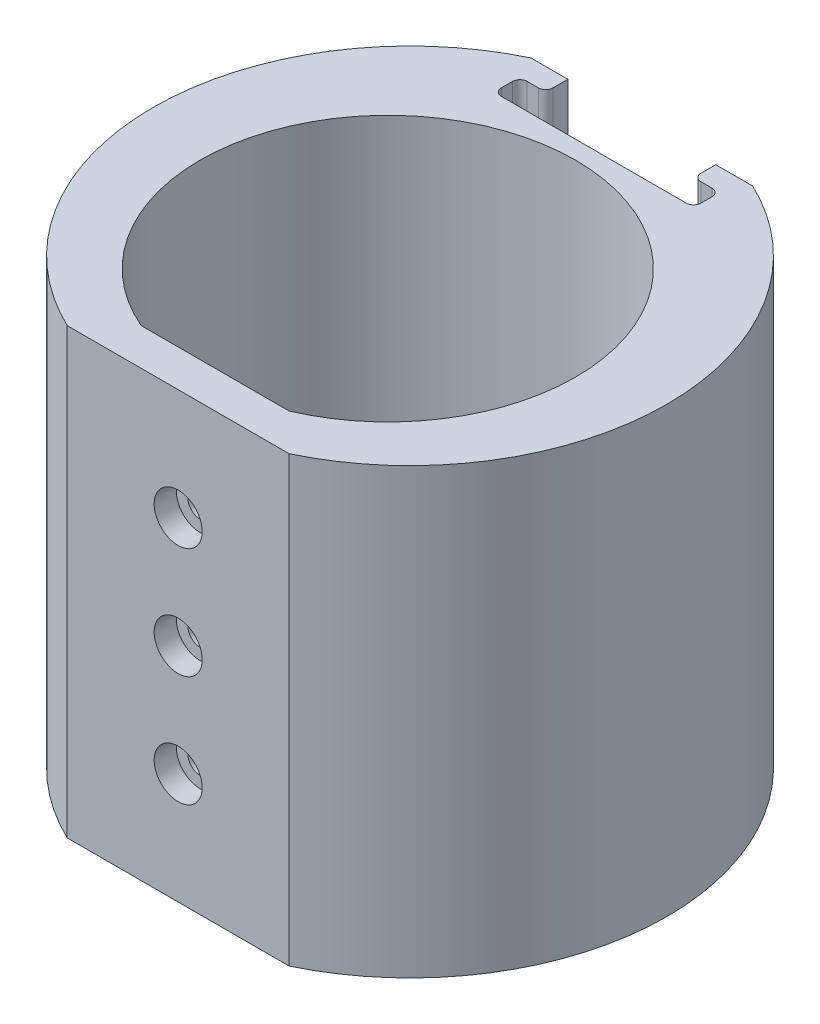
ISO-10303-21;
HEADER;
FILE_DESCRIPTION(('STEP AP214'),'2;1');
FILE_NAME('part.step','',(''),(''),'','','');
FILE_SCHEMA(('AUTOMOTIVE_DESIGN { 1 0 10303 214 1 1 1 1 }'));
ENDSEC;
DATA;
#1=APPLICATION_CONTEXT('core data for automotive mechanical design processes');
#2=APPLICATION_PROTOCOL_DEFINITION('international standard','automotive_design',2000,#1);
#3=PRODUCT_CONTEXT('',#1,'mechanical');
#4=PRODUCT('Part','Part','',(#3));
#5=PRODUCT_RELATED_PRODUCT_CATEGORY('part','',(#4));
#6=PRODUCT_DEFINITION_FORMATION('','',#4);
#7=PRODUCT_DEFINITION_CONTEXT('part definition',#1,'design');
#8=PRODUCT_DEFINITION('design','',#6,#7);
#9=PRODUCT_DEFINITION_SHAPE('','',#8);
#10=(LENGTH_UNIT() NAMED_UNIT(*) SI_UNIT(.MILLI.,.METRE.));
#11=(NAMED_UNIT(*) PLANE_ANGLE_UNIT() SI_UNIT($,.RADIAN.));
#12=(NAMED_UNIT(*) SI_UNIT($,.STERADIAN.) SOLID_ANGLE_UNIT());
#13=UNCERTAINTY_MEASURE_WITH_UNIT(LENGTH_MEASURE(1.E-05),#10,'distance_accuracy_value','');
#14=(GEOMETRIC_REPRESENTATION_CONTEXT(3) GLOBAL_UNCERTAINTY_ASSIGNED_CONTEXT((#13)) GLOBAL_UNIT_ASSIGNED_CONTEXT((#10,
#11,#12)) REPRESENTATION_CONTEXT('',''));
#15=CARTESIAN_POINT('',(0.,0.,0.));
#16=DIRECTION('',(0.,0.,1.));
#17=DIRECTION('',(1.,0.,0.));
#18=AXIS2_PLACEMENT_3D('',#15,#16,#17);
#19=CARTESIAN_POINT('',(-10.,30.,23.3486616318795));
#20=DIRECTION('',(0.,0.,-1.));
#21=DIRECTION('',(-1.,0.,0.));
#22=AXIS2_PLACEMENT_3D('',#19,#20,#21);
#23=PLANE('',#22);
#24=CARTESIAN_POINT('',(0.,0.,23.3486616318795));
#25=DIRECTION('',(0.,0.,-1.));
#26=DIRECTION('',(-1.,0.,0.));
#27=AXIS2_PLACEMENT_3D('',#24,#25,#26);
#28=CIRCLE('',#27,1.7);
#29=CARTESIAN_POINT('',(-1.7,0.,23.3486616318795));
#30=VERTEX_POINT('',#29);
#31=EDGE_CURVE('E747',#30,#30,#28,.F.);
#32=ORIENTED_EDGE('',*,*,#31,.T.);
#33=EDGE_LOOP('',(#32));
#34=FACE_BOUND('',#33,.T.);
#35=DIRECTION('',(1.,0.,0.));
#36=VECTOR('',#35,1.);
#37=CARTESIAN_POINT('',(-10.,-30.,23.3486616318795));
#38=LINE('',#37,#36);
#39=CARTESIAN_POINT('',(-10.,-30.,23.3486616318795));
#40=VERTEX_POINT('',#39);
#41=CARTESIAN_POINT('',(10.,-30.,23.3486616318795));
#42=VERTEX_POINT('',#41);
#43=EDGE_CURVE('E337',#40,#42,#38,.T.);
#44=ORIENTED_EDGE('',*,*,#43,.F.);
#45=DIRECTION('',(0.,-1.,0.));
#46=VECTOR('',#45,1.);
#47=CARTESIAN_POINT('',(-10.,30.,23.3486616318795));
#48=LINE('',#47,#46);
#49=CARTESIAN_POINT('',(-10.,30.,23.3486616318795));
#50=VERTEX_POINT('',#49);
#51=EDGE_CURVE('E221',#50,#40,#48,.T.);
#52=ORIENTED_EDGE('',*,*,#51,.F.);
#53=DIRECTION('',(1.,0.,0.));
#54=VECTOR('',#53,1.);
#55=CARTESIAN_POINT('',(-10.,30.,23.3486616318795));
#56=LINE('',#55,#54);
#57=CARTESIAN_POINT('',(10.,30.,23.3486616318795));
#58=VERTEX_POINT('',#57);
#59=EDGE_CURVE('E336',#50,#58,#56,.T.);
#60=ORIENTED_EDGE('',*,*,#59,.T.);
#61=DIRECTION('',(0.,-1.,0.));
#62=VECTOR('',#61,1.);
#63=CARTESIAN_POINT('',(10.,30.,23.3486616318795));
#64=LINE('',#63,#62);
#65=EDGE_CURVE('E339',#58,#42,#64,.T.);
#66=ORIENTED_EDGE('',*,*,#65,.T.);
#67=EDGE_LOOP('',(#44,#52,#60,#66));
#68=FACE_BOUND('',#67,.T.);
#69=CARTESIAN_POINT('',(1.56198175148581E-13,-15.,23.3486616318795));
#70=DIRECTION('',(0.,0.,-1.));
#71=DIRECTION('',(-1.,0.,0.));
#72=AXIS2_PLACEMENT_3D('',#69,#70,#71);
#73=CIRCLE('',#72,1.7);
#74=CARTESIAN_POINT('',(-1.69999999999984,-15.,23.3486616318795));
#75=VERTEX_POINT('',#74);
#76=EDGE_CURVE('E758',#75,#75,#73,.F.);
#77=ORIENTED_EDGE('',*,*,#76,.T.);
#78=EDGE_LOOP('',(#77));
#79=FACE_BOUND('',#78,.T.);
#80=CARTESIAN_POINT('',(0.,15.,23.3486616318795));
#81=DIRECTION('',(0.,0.,-1.));
#82=DIRECTION('',(-1.,0.,0.));
#83=AXIS2_PLACEMENT_3D('',#80,#81,#82);
#84=CIRCLE('',#83,1.7);
#85=CARTESIAN_POINT('',(-1.7,15.,23.3486616318795));
#86=VERTEX_POINT('',#85);
#87=EDGE_CURVE('E735',#86,#86,#84,.F.);
#88=ORIENTED_EDGE('',*,*,#87,.T.);
#89=EDGE_LOOP('',(#88));
#90=FACE_BOUND('',#89,.T.);
#91=ADVANCED_FACE('F41',(#34,#68,#79,#90),#23,.T.);
#92=CARTESIAN_POINT('',(0.,30.,-3.));
#93=DIRECTION('',(0.,1.,0.));
#94=DIRECTION('',(0.,0.,1.));
#95=AXIS2_PLACEMENT_3D('',#92,#93,#94);
#96=PLANE('',#95);
#97=DIRECTION('',(0.,0.,-1.));
#98=VECTOR('',#97,1.);
#99=CARTESIAN_POINT('',(10.,30.,-31.3486616318795));
#100=LINE('',#99,#98);
#101=CARTESIAN_POINT('',(10.,30.,-32.3486616318795));
#102=VERTEX_POINT('',#101);
#103=CARTESIAN_POINT('',(10.,30.,-34.3486616318795));
#104=VERTEX_POINT('',#103);
#105=EDGE_CURVE('E191',#102,#104,#100,.T.);
#106=ORIENTED_EDGE('',*,*,#105,.F.);
#107=CARTESIAN_POINT('',(11.,30.,-32.3486616318795));
#108=DIRECTION('',(0.,1.,0.));
#109=DIRECTION('',(0.,0.,1.));
#110=AXIS2_PLACEMENT_3D('',#107,#108,#109);
#111=CIRCLE('',#110,1.);
#112=CARTESIAN_POINT('',(11.,30.,-31.3486616318795));
#113=VERTEX_POINT('',#112);
#114=EDGE_CURVE('E242',#102,#113,#111,.T.);
#115=ORIENTED_EDGE('',*,*,#114,.T.);
#116=DIRECTION('',(-1.,0.,0.));
#117=VECTOR('',#116,1.);
#118=CARTESIAN_POINT('',(13.5,30.,-31.3486616318795));
#119=LINE('',#118,#117);
#120=CARTESIAN_POINT('',(12.5,30.,-31.3486616318795));
#121=VERTEX_POINT('',#120);
#122=EDGE_CURVE('E325',#121,#113,#119,.T.);
#123=ORIENTED_EDGE('',*,*,#122,.F.);
#124=CARTESIAN_POINT('',(12.5,30.,-30.3486616318795));
#125=DIRECTION('',(0.,1.,0.));
#126=DIRECTION('',(0.,0.,1.));
#127=AXIS2_PLACEMENT_3D('',#124,#125,#126);
#128=CIRCLE('',#127,1.);
#129=CARTESIAN_POINT('',(13.5,30.,-30.3486616318795));
#130=VERTEX_POINT('',#129);
#131=EDGE_CURVE('E281',#121,#130,#128,.F.);
#132=ORIENTED_EDGE('',*,*,#131,.T.);
#133=DIRECTION('',(0.,0.,-1.));
#134=VECTOR('',#133,1.);
#135=CARTESIAN_POINT('',(13.5,30.,-27.8486616318795));
#136=LINE('',#135,#134);
#137=CARTESIAN_POINT('',(13.5,30.,-28.8486616318795));
#138=VERTEX_POINT('',#137);
#139=EDGE_CURVE('E322',#138,#130,#136,.T.);
#140=ORIENTED_EDGE('',*,*,#139,.F.);
#141=CARTESIAN_POINT('',(12.5,30.,-28.8486616318795));
#142=DIRECTION('',(0.,1.,0.));
#143=DIRECTION('',(0.,0.,1.));
#144=AXIS2_PLACEMENT_3D('',#141,#142,#143);
#145=CIRCLE('',#144,1.);
#146=CARTESIAN_POINT('',(12.5,30.,-27.8486616318795));
#147=VERTEX_POINT('',#146);
#148=EDGE_CURVE('E279',#138,#147,#145,.F.);
#149=ORIENTED_EDGE('',*,*,#148,.T.);
#150=DIRECTION('',(1.,0.,0.));
#151=VECTOR('',#150,1.);
#152=CARTESIAN_POINT('',(-13.5,30.,-27.8486616318795));
#153=LINE('',#152,#151);
#154=CARTESIAN_POINT('',(-12.5,30.,-27.8486616318795));
#155=VERTEX_POINT('',#154);
#156=EDGE_CURVE('E319',#155,#147,#153,.T.);
#157=ORIENTED_EDGE('',*,*,#156,.F.);
#158=CARTESIAN_POINT('',(-12.5,30.,-28.8486616318795));
#159=DIRECTION('',(0.,1.,0.));
#160=DIRECTION('',(0.,0.,1.));
#161=AXIS2_PLACEMENT_3D('',#158,#159,#160);
#162=CIRCLE('',#161,1.);
#163=CARTESIAN_POINT('',(-13.5,30.,-28.8486616318795));
#164=VERTEX_POINT('',#163);
#165=EDGE_CURVE('E283',#155,#164,#162,.F.);
#166=ORIENTED_EDGE('',*,*,#165,.T.);
#167=DIRECTION('',(0.,0.,1.));
#168=VECTOR('',#167,1.);
#169=CARTESIAN_POINT('',(-13.5,30.,-31.3486616318795));
#170=LINE('',#169,#168);
#171=CARTESIAN_POINT('',(-13.5,30.,-30.3486616318795));
#172=VERTEX_POINT('',#171);
#173=EDGE_CURVE('E286',#172,#164,#170,.T.);
#174=ORIENTED_EDGE('',*,*,#173,.F.);
#175=CARTESIAN_POINT('',(-12.5,30.,-30.3486616318795));
#176=DIRECTION('',(0.,1.,0.));
#177=DIRECTION('',(0.,0.,1.));
#178=AXIS2_PLACEMENT_3D('',#175,#176,#177);
#179=CIRCLE('',#178,1.);
#180=CARTESIAN_POINT('',(-12.5,30.,-31.3486616318795));
#181=VERTEX_POINT('',#180);
#182=EDGE_CURVE('E49',#172,#181,#179,.F.);
#183=ORIENTED_EDGE('',*,*,#182,.T.);
#184=DIRECTION('',(-1.,0.,0.));
#185=VECTOR('',#184,1.);
#186=CARTESIAN_POINT('',(-10.,30.,-31.3486616318795));
#187=LINE('',#186,#185);
#188=CARTESIAN_POINT('',(-11.,30.,-31.3486616318795));
#189=VERTEX_POINT('',#188);
#190=EDGE_CURVE('E202',#189,#181,#187,.T.);
#191=ORIENTED_EDGE('',*,*,#190,.F.);
#192=CARTESIAN_POINT('',(-11.,30.,-32.3486616318795));
#193=DIRECTION('',(0.,1.,0.));
#194=DIRECTION('',(0.,0.,1.));
#195=AXIS2_PLACEMENT_3D('',#192,#193,#194);
#196=CIRCLE('',#195,1.);
#197=CARTESIAN_POINT('',(-10.,30.,-32.3486616318795));
#198=VERTEX_POINT('',#197);
#199=EDGE_CURVE('E201',#189,#198,#196,.T.);
#200=ORIENTED_EDGE('',*,*,#199,.T.);
#201=DIRECTION('',(0.,0.,1.));
#202=VECTOR('',#201,1.);
#203=CARTESIAN_POINT('',(-10.,30.,-34.3486616318795));
#204=LINE('',#203,#202);
#205=CARTESIAN_POINT('',(-10.,30.,-34.3486616318795));
#206=VERTEX_POINT('',#205);
#207=EDGE_CURVE('E182',#206,#198,#204,.T.);
#208=ORIENTED_EDGE('',*,*,#207,.F.);
#209=DIRECTION('',(-1.,0.,0.));
#210=VECTOR('',#209,1.);
#211=CARTESIAN_POINT('',(-15.,30.,-34.3486616318795));
#212=LINE('',#211,#210);
#213=CARTESIAN_POINT('',(-15.,30.,-34.3486616318795));
#214=VERTEX_POINT('',#213);
#215=EDGE_CURVE('E198',#206,#214,#212,.T.);
#216=ORIENTED_EDGE('',*,*,#215,.T.);
#217=CARTESIAN_POINT('',(0.,30.,-3.));
#218=DIRECTION('',(0.,1.,0.));
#219=DIRECTION('',(0.,0.,1.));
#220=AXIS2_PLACEMENT_3D('',#217,#218,#219);
#221=CIRCLE('',#220,34.7525335207388);
#222=CARTESIAN_POINT('',(-15.,30.,28.3486616318795));
#223=VERTEX_POINT('',#222);
#224=EDGE_CURVE('E227',#214,#223,#221,.T.);
#225=ORIENTED_EDGE('',*,*,#224,.T.);
#226=DIRECTION('',(1.,0.,0.));
#227=VECTOR('',#226,1.);
#228=CARTESIAN_POINT('',(-15.,30.,28.3486616318795));
#229=LINE('',#228,#227);
#230=CARTESIAN_POINT('',(15.,30.,28.3486616318795));
#231=VERTEX_POINT('',#230);
#232=EDGE_CURVE('E213',#223,#231,#229,.T.);
#233=ORIENTED_EDGE('',*,*,#232,.T.);
#234=CARTESIAN_POINT('',(0.,30.,-3.));
#235=DIRECTION('',(0.,1.,0.));
#236=DIRECTION('',(0.,0.,1.));
#237=AXIS2_PLACEMENT_3D('',#234,#235,#236);
#238=CIRCLE('',#237,34.7525335207388);
#239=CARTESIAN_POINT('',(15.,30.,-34.3486616318795));
#240=VERTEX_POINT('',#239);
#241=EDGE_CURVE('E210',#231,#240,#238,.T.);
#242=ORIENTED_EDGE('',*,*,#241,.T.);
#243=EDGE_CURVE('E209',#240,#104,#212,.T.);
#244=ORIENTED_EDGE('',*,*,#243,.T.);
#245=EDGE_LOOP('',(#106,#115,#123,#132,#140,#149,#157,#166,#174,#183,#191,#200,#208,#216,#225,
#233,#242,#244));
#246=FACE_BOUND('',#245,.T.);
#247=ORIENTED_EDGE('',*,*,#59,.F.);
#248=CARTESIAN_POINT('',(0.,30.,0.));
#249=DIRECTION('',(0.,1.,0.));
#250=DIRECTION('',(0.,0.,1.));
#251=AXIS2_PLACEMENT_3D('',#248,#249,#250);
#252=CIRCLE('',#251,25.4);
#253=EDGE_CURVE('E333',#58,#50,#252,.T.);
#254=ORIENTED_EDGE('',*,*,#253,.F.);
#255=EDGE_LOOP('',(#247,#254));
#256=FACE_BOUND('',#255,.T.);
#257=ADVANCED_FACE('F195',(#246,#256),#96,.T.);
#258=CARTESIAN_POINT('',(0.,-30.,-3.));
#259=DIRECTION('',(0.,1.,0.));
#260=DIRECTION('',(0.,0.,1.));
#261=AXIS2_PLACEMENT_3D('',#258,#259,#260);
#262=PLANE('',#261);
#263=CARTESIAN_POINT('',(0.,-30.,-3.));
#264=DIRECTION('',(0.,1.,0.));
#265=DIRECTION('',(0.,0.,1.));
#266=AXIS2_PLACEMENT_3D('',#263,#264,#265);
#267=CIRCLE('',#266,34.7525335207388);
#268=CARTESIAN_POINT('',(-15.,-30.,-34.3486616318795));
#269=VERTEX_POINT('',#268);
#270=CARTESIAN_POINT('',(-15.,-30.,28.3486616318795));
#271=VERTEX_POINT('',#270);
#272=EDGE_CURVE('E217',#269,#271,#267,.T.);
#273=ORIENTED_EDGE('',*,*,#272,.F.);
#274=DIRECTION('',(-1.,0.,0.));
#275=VECTOR('',#274,1.);
#276=CARTESIAN_POINT('',(-15.,-30.,-34.3486616318795));
#277=LINE('',#276,#275);
#278=CARTESIAN_POINT('',(15.,-30.,-34.3486616318795));
#279=VERTEX_POINT('',#278);
#280=EDGE_CURVE('E225',#279,#269,#277,.T.);
#281=ORIENTED_EDGE('',*,*,#280,.F.);
#282=CARTESIAN_POINT('',(0.,-30.,-3.));
#283=DIRECTION('',(0.,1.,0.));
#284=DIRECTION('',(0.,0.,1.));
#285=AXIS2_PLACEMENT_3D('',#282,#283,#284);
#286=CIRCLE('',#285,34.7525335207388);
#287=CARTESIAN_POINT('',(15.,-30.,28.3486616318795));
#288=VERTEX_POINT('',#287);
#289=EDGE_CURVE('E223',#288,#279,#286,.T.);
#290=ORIENTED_EDGE('',*,*,#289,.F.);
#291=DIRECTION('',(1.,0.,0.));
#292=VECTOR('',#291,1.);
#293=CARTESIAN_POINT('',(-15.,-30.,28.3486616318795));
#294=LINE('',#293,#292);
#295=EDGE_CURVE('E220',#271,#288,#294,.T.);
#296=ORIENTED_EDGE('',*,*,#295,.F.);
#297=EDGE_LOOP('',(#273,#281,#290,#296));
#298=FACE_BOUND('',#297,.T.);
#299=CARTESIAN_POINT('',(0.,-30.,0.));
#300=DIRECTION('',(0.,1.,0.));
#301=DIRECTION('',(0.,0.,1.));
#302=AXIS2_PLACEMENT_3D('',#299,#300,#301);
#303=CIRCLE('',#302,25.4);
#304=EDGE_CURVE('E332',#42,#40,#303,.T.);
#305=ORIENTED_EDGE('',*,*,#304,.T.);
#306=ORIENTED_EDGE('',*,*,#43,.T.);
#307=EDGE_LOOP('',(#305,#306));
#308=FACE_BOUND('',#307,.T.);
#309=ADVANCED_FACE('F406',(#298,#308),#262,.F.);
#310=CARTESIAN_POINT('',(0.,30.,-3.));
#311=DIRECTION('',(0.,-1.,0.));
#312=DIRECTION('',(0.,0.,-1.));
#313=AXIS2_PLACEMENT_3D('',#310,#311,#312);
#314=CYLINDRICAL_SURFACE('',#313,34.7525335207388);
#315=ORIENTED_EDGE('',*,*,#272,.T.);
#316=DIRECTION('',(0.,-1.,0.));
#317=VECTOR('',#316,1.);
#318=CARTESIAN_POINT('',(-15.,30.,28.3486616318795));
#319=LINE('',#318,#317);
#320=EDGE_CURVE('E235',#223,#271,#319,.T.);
#321=ORIENTED_EDGE('',*,*,#320,.F.);
#322=ORIENTED_EDGE('',*,*,#224,.F.);
#323=DIRECTION('',(0.,-1.,0.));
#324=VECTOR('',#323,1.);
#325=CARTESIAN_POINT('',(-15.,30.,-34.3486616318795));
#326=LINE('',#325,#324);
#327=EDGE_CURVE('E207',#214,#269,#326,.T.);
#328=ORIENTED_EDGE('',*,*,#327,.T.);
#329=EDGE_LOOP('',(#315,#321,#322,#328));
#330=FACE_BOUND('',#329,.T.);
#331=ADVANCED_FACE('F419',(#330),#314,.T.);
#332=CARTESIAN_POINT('',(-15.,30.,28.3486616318795));
#333=DIRECTION('',(0.,0.,-1.));
#334=DIRECTION('',(-1.,0.,0.));
#335=AXIS2_PLACEMENT_3D('',#332,#333,#334);
#336=PLANE('',#335);
#337=CARTESIAN_POINT('',(0.,15.,28.3486616318795));
#338=DIRECTION('',(0.,0.,1.));
#339=DIRECTION('',(1.,0.,0.));
#340=AXIS2_PLACEMENT_3D('',#337,#338,#339);
#341=CIRCLE('',#340,3.25);
#342=CARTESIAN_POINT('',(3.25,15.,28.3486616318795));
#343=VERTEX_POINT('',#342);
#344=EDGE_CURVE('E734',#343,#343,#341,.T.);
#345=ORIENTED_EDGE('',*,*,#344,.F.);
#346=EDGE_LOOP('',(#345));
#347=FACE_BOUND('',#346,.T.);
#348=CARTESIAN_POINT('',(0.,0.,28.3486616318795));
#349=DIRECTION('',(0.,0.,1.));
#350=DIRECTION('',(1.,0.,0.));
#351=AXIS2_PLACEMENT_3D('',#348,#349,#350);
#352=CIRCLE('',#351,3.25);
#353=CARTESIAN_POINT('',(3.25,0.,28.3486616318795));
#354=VERTEX_POINT('',#353);
#355=EDGE_CURVE('E751',#354,#354,#352,.T.);
#356=ORIENTED_EDGE('',*,*,#355,.F.);
#357=EDGE_LOOP('',(#356));
#358=FACE_BOUND('',#357,.T.);
#359=CARTESIAN_POINT('',(1.56198175148581E-13,-15.,28.3486616318795));
#360=DIRECTION('',(0.,0.,1.));
#361=DIRECTION('',(1.,0.,0.));
#362=AXIS2_PLACEMENT_3D('',#359,#360,#361);
#363=CIRCLE('',#362,3.25);
#364=CARTESIAN_POINT('',(3.25000000000015,-15.,28.3486616318795));
#365=VERTEX_POINT('',#364);
#366=EDGE_CURVE('E750',#365,#365,#363,.T.);
#367=ORIENTED_EDGE('',*,*,#366,.F.);
#368=EDGE_LOOP('',(#367));
#369=FACE_BOUND('',#368,.T.);
#370=ORIENTED_EDGE('',*,*,#295,.T.);
#371=DIRECTION('',(0.,-1.,0.));
#372=VECTOR('',#371,1.);
#373=CARTESIAN_POINT('',(15.,30.,28.3486616318795));
#374=LINE('',#373,#372);
#375=EDGE_CURVE('E232',#231,#288,#374,.T.);
#376=ORIENTED_EDGE('',*,*,#375,.F.);
#377=ORIENTED_EDGE('',*,*,#232,.F.);
#378=ORIENTED_EDGE('',*,*,#320,.T.);
#379=EDGE_LOOP('',(#370,#376,#377,#378));
#380=FACE_BOUND('',#379,.T.);
#381=ADVANCED_FACE('F353',(#347,#358,#369,#380),#336,.F.);
#382=CARTESIAN_POINT('',(0.,30.,-3.));
#383=DIRECTION('',(0.,-1.,0.));
#384=DIRECTION('',(0.,0.,-1.));
#385=AXIS2_PLACEMENT_3D('',#382,#383,#384);
#386=CYLINDRICAL_SURFACE('',#385,34.7525335207388);
#387=ORIENTED_EDGE('',*,*,#289,.T.);
#388=DIRECTION('',(0.,-1.,0.));
#389=VECTOR('',#388,1.);
#390=CARTESIAN_POINT('',(15.,30.,-34.3486616318795));
#391=LINE('',#390,#389);
#392=EDGE_CURVE('E229',#240,#279,#391,.T.);
#393=ORIENTED_EDGE('',*,*,#392,.F.);
#394=ORIENTED_EDGE('',*,*,#241,.F.);
#395=ORIENTED_EDGE('',*,*,#375,.T.);
#396=EDGE_LOOP('',(#387,#393,#394,#395));
#397=FACE_BOUND('',#396,.T.);
#398=ADVANCED_FACE('F356',(#397),#386,.T.);
#399=CARTESIAN_POINT('',(-15.,30.,-34.3486616318795));
#400=DIRECTION('',(0.,0.,1.));
#401=DIRECTION('',(1.,0.,0.));
#402=AXIS2_PLACEMENT_3D('',#399,#400,#401);
#403=PLANE('',#402);
#404=DIRECTION('',(1.,0.,0.));
#405=VECTOR('',#404,1.);
#406=CARTESIAN_POINT('',(10.,-20.,-34.3486616318795));
#407=LINE('',#406,#405);
#408=CARTESIAN_POINT('',(-10.,-20.,-34.3486616318795));
#409=VERTEX_POINT('',#408);
#410=CARTESIAN_POINT('',(10.,-20.,-34.3486616318795));
#411=VERTEX_POINT('',#410);
#412=EDGE_CURVE('E316',#409,#411,#407,.T.);
#413=ORIENTED_EDGE('',*,*,#412,.T.);
#414=DIRECTION('',(0.,1.,0.));
#415=VECTOR('',#414,1.);
#416=CARTESIAN_POINT('',(10.,-57.7713881539976,-34.3486616318795));
#417=LINE('',#416,#415);
#418=EDGE_CURVE('E190',#411,#104,#417,.T.);
#419=ORIENTED_EDGE('',*,*,#418,.T.);
#420=ORIENTED_EDGE('',*,*,#243,.F.);
#421=ORIENTED_EDGE('',*,*,#392,.T.);
#422=ORIENTED_EDGE('',*,*,#280,.T.);
#423=ORIENTED_EDGE('',*,*,#327,.F.);
#424=ORIENTED_EDGE('',*,*,#215,.F.);
#425=DIRECTION('',(0.,1.,0.));
#426=VECTOR('',#425,1.);
#427=CARTESIAN_POINT('',(-10.,-57.7713881539976,-34.3486616318795));
#428=LINE('',#427,#426);
#429=EDGE_CURVE('E179',#409,#206,#428,.T.);
#430=ORIENTED_EDGE('',*,*,#429,.F.);
#431=EDGE_LOOP('',(#413,#419,#420,#421,#422,#423,#424,#430));
#432=FACE_BOUND('',#431,.T.);
#433=ADVANCED_FACE('F205',(#432),#403,.F.);
#434=CARTESIAN_POINT('',(0.,30.,0.));
#435=DIRECTION('',(0.,-1.,0.));
#436=DIRECTION('',(0.,0.,-1.));
#437=AXIS2_PLACEMENT_3D('',#434,#435,#436);
#438=CYLINDRICAL_SURFACE('',#437,25.4);
#439=ORIENTED_EDGE('',*,*,#304,.F.);
#440=ORIENTED_EDGE('',*,*,#65,.F.);
#441=ORIENTED_EDGE('',*,*,#253,.T.);
#442=ORIENTED_EDGE('',*,*,#51,.T.);
#443=EDGE_LOOP('',(#439,#440,#441,#442));
#444=FACE_BOUND('',#443,.T.);
#445=ADVANCED_FACE('F413',(#444),#438,.F.);
#446=CARTESIAN_POINT('',(10.,-57.7713881539976,-31.3486616318795));
#447=DIRECTION('',(1.,0.,0.));
#448=DIRECTION('',(0.,0.,-1.));
#449=AXIS2_PLACEMENT_3D('',#446,#447,#448);
#450=PLANE('',#449);
#451=DIRECTION('',(0.,0.,1.));
#452=VECTOR('',#451,1.);
#453=CARTESIAN_POINT('',(10.,-20.,-31.3486616318795));
#454=LINE('',#453,#452);
#455=CARTESIAN_POINT('',(10.,-20.,-32.3486616318795));
#456=VERTEX_POINT('',#455);
#457=EDGE_CURVE('E313',#411,#456,#454,.T.);
#458=ORIENTED_EDGE('',*,*,#457,.T.);
#459=DIRECTION('',(0.,1.,0.));
#460=VECTOR('',#459,1.);
#461=CARTESIAN_POINT('',(10.,-57.7713881539976,-32.3486616318795));
#462=LINE('',#461,#460);
#463=EDGE_CURVE('E238',#456,#102,#462,.T.);
#464=ORIENTED_EDGE('',*,*,#463,.T.);
#465=ORIENTED_EDGE('',*,*,#105,.T.);
#466=ORIENTED_EDGE('',*,*,#418,.F.);
#467=EDGE_LOOP('',(#458,#464,#465,#466));
#468=FACE_BOUND('',#467,.T.);
#469=ADVANCED_FACE('F361',(#468),#450,.F.);
#470=CARTESIAN_POINT('',(13.5,-57.7713881539976,-31.3486616318795));
#471=DIRECTION('',(0.,0.,-1.));
#472=DIRECTION('',(-1.,0.,0.));
#473=AXIS2_PLACEMENT_3D('',#470,#471,#472);
#474=PLANE('',#473);
#475=ORIENTED_EDGE('',*,*,#122,.T.);
#476=DIRECTION('',(0.,1.,0.));
#477=VECTOR('',#476,1.);
#478=CARTESIAN_POINT('',(11.,-57.7713881539976,-31.3486616318795));
#479=LINE('',#478,#477);
#480=CARTESIAN_POINT('',(11.,-20.,-31.3486616318795));
#481=VERTEX_POINT('',#480);
#482=EDGE_CURVE('E247',#113,#481,#479,.F.);
#483=ORIENTED_EDGE('',*,*,#482,.T.);
#484=DIRECTION('',(1.,0.,0.));
#485=VECTOR('',#484,1.);
#486=CARTESIAN_POINT('',(13.5,-20.,-31.3486616318795));
#487=LINE('',#486,#485);
#488=CARTESIAN_POINT('',(12.5,-20.,-31.3486616318795));
#489=VERTEX_POINT('',#488);
#490=EDGE_CURVE('E310',#481,#489,#487,.T.);
#491=ORIENTED_EDGE('',*,*,#490,.T.);
#492=DIRECTION('',(0.,1.,0.));
#493=VECTOR('',#492,1.);
#494=CARTESIAN_POINT('',(12.5,30.,-31.3486616318795));
#495=LINE('',#494,#493);
#496=EDGE_CURVE('E244',#489,#121,#495,.T.);
#497=ORIENTED_EDGE('',*,*,#496,.T.);
#498=EDGE_LOOP('',(#475,#483,#491,#497));
#499=FACE_BOUND('',#498,.T.);
#500=ADVANCED_FACE('F370',(#499),#474,.F.);
#501=CARTESIAN_POINT('',(13.5,-57.7713881539976,-27.8486616318795));
#502=DIRECTION('',(1.,0.,0.));
#503=DIRECTION('',(0.,0.,-1.));
#504=AXIS2_PLACEMENT_3D('',#501,#502,#503);
#505=PLANE('',#504);
#506=DIRECTION('',(0.,0.,1.));
#507=VECTOR('',#506,1.);
#508=CARTESIAN_POINT('',(13.5,-20.,-27.8486616318795));
#509=LINE('',#508,#507);
#510=CARTESIAN_POINT('',(13.5,-20.,-30.3486616318795));
#511=VERTEX_POINT('',#510);
#512=CARTESIAN_POINT('',(13.5,-20.,-28.8486616318795));
#513=VERTEX_POINT('',#512);
#514=EDGE_CURVE('E303',#511,#513,#509,.T.);
#515=ORIENTED_EDGE('',*,*,#514,.T.);
#516=DIRECTION('',(0.,1.,0.));
#517=VECTOR('',#516,1.);
#518=CARTESIAN_POINT('',(13.5,30.,-28.8486616318795));
#519=LINE('',#518,#517);
#520=EDGE_CURVE('E251',#513,#138,#519,.T.);
#521=ORIENTED_EDGE('',*,*,#520,.T.);
#522=ORIENTED_EDGE('',*,*,#139,.T.);
#523=DIRECTION('',(0.,1.,0.));
#524=VECTOR('',#523,1.);
#525=CARTESIAN_POINT('',(13.5,-20.,-30.3486616318795));
#526=LINE('',#525,#524);
#527=EDGE_CURVE('E249',#130,#511,#526,.F.);
#528=ORIENTED_EDGE('',*,*,#527,.T.);
#529=EDGE_LOOP('',(#515,#521,#522,#528));
#530=FACE_BOUND('',#529,.T.);
#531=ADVANCED_FACE('F381',(#530),#505,.F.);
#532=CARTESIAN_POINT('',(-13.5,-57.7713881539976,-27.8486616318795));
#533=DIRECTION('',(0.,0.,1.));
#534=DIRECTION('',(1.,0.,0.));
#535=AXIS2_PLACEMENT_3D('',#532,#533,#534);
#536=PLANE('',#535);
#537=ORIENTED_EDGE('',*,*,#156,.T.);
#538=DIRECTION('',(0.,1.,0.));
#539=VECTOR('',#538,1.);
#540=CARTESIAN_POINT('',(12.5,-20.,-27.8486616318795));
#541=LINE('',#540,#539);
#542=CARTESIAN_POINT('',(12.5,-20.,-27.8486616318795));
#543=VERTEX_POINT('',#542);
#544=EDGE_CURVE('E257',#147,#543,#541,.F.);
#545=ORIENTED_EDGE('',*,*,#544,.T.);
#546=DIRECTION('',(-1.,0.,0.));
#547=VECTOR('',#546,1.);
#548=CARTESIAN_POINT('',(-13.5,-20.,-27.8486616318795));
#549=LINE('',#548,#547);
#550=CARTESIAN_POINT('',(-12.5,-20.,-27.8486616318795));
#551=VERTEX_POINT('',#550);
#552=EDGE_CURVE('E299',#543,#551,#549,.T.);
#553=ORIENTED_EDGE('',*,*,#552,.T.);
#554=DIRECTION('',(0.,1.,0.));
#555=VECTOR('',#554,1.);
#556=CARTESIAN_POINT('',(-12.5,30.,-27.8486616318795));
#557=LINE('',#556,#555);
#558=EDGE_CURVE('E254',#551,#155,#557,.T.);
#559=ORIENTED_EDGE('',*,*,#558,.T.);
#560=EDGE_LOOP('',(#537,#545,#553,#559));
#561=FACE_BOUND('',#560,.T.);
#562=ADVANCED_FACE('F389',(#561),#536,.F.);
#563=CARTESIAN_POINT('',(-13.5,-57.7713881539976,-31.3486616318795));
#564=DIRECTION('',(-1.,0.,0.));
#565=DIRECTION('',(0.,0.,1.));
#566=AXIS2_PLACEMENT_3D('',#563,#564,#565);
#567=PLANE('',#566);
#568=ORIENTED_EDGE('',*,*,#173,.T.);
#569=DIRECTION('',(0.,1.,0.));
#570=VECTOR('',#569,1.);
#571=CARTESIAN_POINT('',(-13.5,-20.,-28.8486616318795));
#572=LINE('',#571,#570);
#573=CARTESIAN_POINT('',(-13.5,-20.,-28.8486616318795));
#574=VERTEX_POINT('',#573);
#575=EDGE_CURVE('E63',#164,#574,#572,.F.);
#576=ORIENTED_EDGE('',*,*,#575,.T.);
#577=DIRECTION('',(0.,0.,-1.));
#578=VECTOR('',#577,1.);
#579=CARTESIAN_POINT('',(-13.5,-20.,-31.3486616318795));
#580=LINE('',#579,#578);
#581=CARTESIAN_POINT('',(-13.5,-20.,-30.3486616318795));
#582=VERTEX_POINT('',#581);
#583=EDGE_CURVE('E297',#574,#582,#580,.T.);
#584=ORIENTED_EDGE('',*,*,#583,.T.);
#585=DIRECTION('',(0.,1.,0.));
#586=VECTOR('',#585,1.);
#587=CARTESIAN_POINT('',(-13.5,30.,-30.3486616318795));
#588=LINE('',#587,#586);
#589=EDGE_CURVE('E266',#582,#172,#588,.T.);
#590=ORIENTED_EDGE('',*,*,#589,.T.);
#591=EDGE_LOOP('',(#568,#576,#584,#590));
#592=FACE_BOUND('',#591,.T.);
#593=ADVANCED_FACE('F296',(#592),#567,.F.);
#594=CARTESIAN_POINT('',(-10.,-57.7713881539976,-31.3486616318795));
#595=DIRECTION('',(0.,0.,-1.));
#596=DIRECTION('',(-1.,0.,0.));
#597=AXIS2_PLACEMENT_3D('',#594,#595,#596);
#598=PLANE('',#597);
#599=ORIENTED_EDGE('',*,*,#190,.T.);
#600=DIRECTION('',(0.,1.,0.));
#601=VECTOR('',#600,1.);
#602=CARTESIAN_POINT('',(-12.5,-20.,-31.3486616318795));
#603=LINE('',#602,#601);
#604=CARTESIAN_POINT('',(-12.5,-20.,-31.3486616318795));
#605=VERTEX_POINT('',#604);
#606=EDGE_CURVE('E273',#181,#605,#603,.F.);
#607=ORIENTED_EDGE('',*,*,#606,.T.);
#608=DIRECTION('',(1.,0.,0.));
#609=VECTOR('',#608,1.);
#610=CARTESIAN_POINT('',(-10.,-20.,-31.3486616318795));
#611=LINE('',#610,#609);
#612=CARTESIAN_POINT('',(-11.,-20.,-31.3486616318795));
#613=VERTEX_POINT('',#612);
#614=EDGE_CURVE('E300',#605,#613,#611,.T.);
#615=ORIENTED_EDGE('',*,*,#614,.T.);
#616=DIRECTION('',(0.,1.,0.));
#617=VECTOR('',#616,1.);
#618=CARTESIAN_POINT('',(-11.,-57.7713881539976,-31.3486616318795));
#619=LINE('',#618,#617);
#620=EDGE_CURVE('E270',#613,#189,#619,.T.);
#621=ORIENTED_EDGE('',*,*,#620,.T.);
#622=EDGE_LOOP('',(#599,#607,#615,#621));
#623=FACE_BOUND('',#622,.T.);
#624=ADVANCED_FACE('F291',(#623),#598,.F.);
#625=CARTESIAN_POINT('',(-10.,-57.7713881539976,-34.3486616318795));
#626=DIRECTION('',(-1.,0.,0.));
#627=DIRECTION('',(0.,0.,1.));
#628=AXIS2_PLACEMENT_3D('',#625,#626,#627);
#629=PLANE('',#628);
#630=ORIENTED_EDGE('',*,*,#207,.T.);
#631=DIRECTION('',(0.,1.,0.));
#632=VECTOR('',#631,1.);
#633=CARTESIAN_POINT('',(-10.,-57.7713881539976,-32.3486616318795));
#634=LINE('',#633,#632);
#635=CARTESIAN_POINT('',(-10.,-20.,-32.3486616318795));
#636=VERTEX_POINT('',#635);
#637=EDGE_CURVE('E275',#198,#636,#634,.F.);
#638=ORIENTED_EDGE('',*,*,#637,.T.);
#639=DIRECTION('',(0.,0.,-1.));
#640=VECTOR('',#639,1.);
#641=CARTESIAN_POINT('',(-10.,-20.,-34.3486616318795));
#642=LINE('',#641,#640);
#643=EDGE_CURVE('E185',#636,#409,#642,.T.);
#644=ORIENTED_EDGE('',*,*,#643,.T.);
#645=ORIENTED_EDGE('',*,*,#429,.T.);
#646=EDGE_LOOP('',(#630,#638,#644,#645));
#647=FACE_BOUND('',#646,.T.);
#648=ADVANCED_FACE('F181',(#647),#629,.F.);
#649=CARTESIAN_POINT('',(0.,-20.,-3.));
#650=DIRECTION('',(0.,1.,0.));
#651=DIRECTION('',(0.,0.,1.));
#652=AXIS2_PLACEMENT_3D('',#649,#650,#651);
#653=PLANE('',#652);
#654=ORIENTED_EDGE('',*,*,#552,.F.);
#655=CARTESIAN_POINT('',(12.5,-20.,-28.8486616318795));
#656=DIRECTION('',(0.,1.,0.));
#657=DIRECTION('',(0.,0.,1.));
#658=AXIS2_PLACEMENT_3D('',#655,#656,#657);
#659=CIRCLE('',#658,1.);
#660=EDGE_CURVE('E264',#543,#513,#659,.T.);
#661=ORIENTED_EDGE('',*,*,#660,.T.);
#662=ORIENTED_EDGE('',*,*,#514,.F.);
#663=CARTESIAN_POINT('',(12.5,-20.,-30.3486616318795));
#664=DIRECTION('',(0.,1.,0.));
#665=DIRECTION('',(0.,0.,1.));
#666=AXIS2_PLACEMENT_3D('',#663,#664,#665);
#667=CIRCLE('',#666,1.);
#668=EDGE_CURVE('E262',#511,#489,#667,.T.);
#669=ORIENTED_EDGE('',*,*,#668,.T.);
#670=ORIENTED_EDGE('',*,*,#490,.F.);
#671=CARTESIAN_POINT('',(11.,-20.,-32.3486616318795));
#672=DIRECTION('',(0.,1.,0.));
#673=DIRECTION('',(0.,0.,1.));
#674=AXIS2_PLACEMENT_3D('',#671,#672,#673);
#675=CIRCLE('',#674,1.);
#676=EDGE_CURVE('E277',#481,#456,#675,.F.);
#677=ORIENTED_EDGE('',*,*,#676,.T.);
#678=ORIENTED_EDGE('',*,*,#457,.F.);
#679=ORIENTED_EDGE('',*,*,#412,.F.);
#680=ORIENTED_EDGE('',*,*,#643,.F.);
#681=CARTESIAN_POINT('',(-11.,-20.,-32.3486616318795));
#682=DIRECTION('',(0.,1.,0.));
#683=DIRECTION('',(0.,0.,1.));
#684=AXIS2_PLACEMENT_3D('',#681,#682,#683);
#685=CIRCLE('',#684,1.);
#686=EDGE_CURVE('E12',#636,#613,#685,.F.);
#687=ORIENTED_EDGE('',*,*,#686,.T.);
#688=ORIENTED_EDGE('',*,*,#614,.F.);
#689=CARTESIAN_POINT('',(-12.5,-20.,-30.3486616318795));
#690=DIRECTION('',(0.,1.,0.));
#691=DIRECTION('',(0.,0.,1.));
#692=AXIS2_PLACEMENT_3D('',#689,#690,#691);
#693=CIRCLE('',#692,1.);
#694=EDGE_CURVE('E56',#605,#582,#693,.T.);
#695=ORIENTED_EDGE('',*,*,#694,.T.);
#696=ORIENTED_EDGE('',*,*,#583,.F.);
#697=CARTESIAN_POINT('',(-12.5,-20.,-28.8486616318795));
#698=DIRECTION('',(0.,1.,0.));
#699=DIRECTION('',(0.,0.,1.));
#700=AXIS2_PLACEMENT_3D('',#697,#698,#699);
#701=CIRCLE('',#700,1.);
#702=EDGE_CURVE('E260',#574,#551,#701,.T.);
#703=ORIENTED_EDGE('',*,*,#702,.T.);
#704=EDGE_LOOP('',(#654,#661,#662,#669,#670,#677,#678,#679,#680,#687,#688,#695,#696,#703));
#705=FACE_BOUND('',#704,.T.);
#706=ADVANCED_FACE('F373',(#705),#653,.T.);
#707=CARTESIAN_POINT('',(11.,-57.7713881539976,-32.3486616318795));
#708=DIRECTION('',(0.,1.,0.));
#709=DIRECTION('',(0.,0.,1.));
#710=AXIS2_PLACEMENT_3D('',#707,#708,#709);
#711=CYLINDRICAL_SURFACE('',#710,1.);
#712=ORIENTED_EDGE('',*,*,#676,.F.);
#713=ORIENTED_EDGE('',*,*,#482,.F.);
#714=ORIENTED_EDGE('',*,*,#114,.F.);
#715=ORIENTED_EDGE('',*,*,#463,.F.);
#716=EDGE_LOOP('',(#712,#713,#714,#715));
#717=FACE_BOUND('',#716,.T.);
#718=ADVANCED_FACE('F366',(#717),#711,.T.);
#719=CARTESIAN_POINT('',(12.5,-57.7713881539976,-28.8486616318795));
#720=DIRECTION('',(0.,-1.,0.));
#721=DIRECTION('',(0.,0.,-1.));
#722=AXIS2_PLACEMENT_3D('',#719,#720,#721);
#723=CYLINDRICAL_SURFACE('',#722,1.);
#724=ORIENTED_EDGE('',*,*,#660,.F.);
#725=ORIENTED_EDGE('',*,*,#544,.F.);
#726=ORIENTED_EDGE('',*,*,#148,.F.);
#727=ORIENTED_EDGE('',*,*,#520,.F.);
#728=EDGE_LOOP('',(#724,#725,#726,#727));
#729=FACE_BOUND('',#728,.T.);
#730=ADVANCED_FACE('F385',(#729),#723,.F.);
#731=CARTESIAN_POINT('',(12.5,-57.7713881539976,-30.3486616318795));
#732=DIRECTION('',(0.,-1.,0.));
#733=DIRECTION('',(0.,0.,-1.));
#734=AXIS2_PLACEMENT_3D('',#731,#732,#733);
#735=CYLINDRICAL_SURFACE('',#734,1.);
#736=ORIENTED_EDGE('',*,*,#668,.F.);
#737=ORIENTED_EDGE('',*,*,#527,.F.);
#738=ORIENTED_EDGE('',*,*,#131,.F.);
#739=ORIENTED_EDGE('',*,*,#496,.F.);
#740=EDGE_LOOP('',(#736,#737,#738,#739));
#741=FACE_BOUND('',#740,.T.);
#742=ADVANCED_FACE('F378',(#741),#735,.F.);
#743=CARTESIAN_POINT('',(-12.5,-57.7713881539976,-28.8486616318795));
#744=DIRECTION('',(0.,-1.,0.));
#745=DIRECTION('',(0.,0.,-1.));
#746=AXIS2_PLACEMENT_3D('',#743,#744,#745);
#747=CYLINDRICAL_SURFACE('',#746,1.);
#748=ORIENTED_EDGE('',*,*,#702,.F.);
#749=ORIENTED_EDGE('',*,*,#575,.F.);
#750=ORIENTED_EDGE('',*,*,#165,.F.);
#751=ORIENTED_EDGE('',*,*,#558,.F.);
#752=EDGE_LOOP('',(#748,#749,#750,#751));
#753=FACE_BOUND('',#752,.T.);
#754=ADVANCED_FACE('F392',(#753),#747,.F.);
#755=CARTESIAN_POINT('',(-12.5,-57.7713881539976,-30.3486616318795));
#756=DIRECTION('',(0.,-1.,0.));
#757=DIRECTION('',(0.,0.,-1.));
#758=AXIS2_PLACEMENT_3D('',#755,#756,#757);
#759=CYLINDRICAL_SURFACE('',#758,1.);
#760=ORIENTED_EDGE('',*,*,#694,.F.);
#761=ORIENTED_EDGE('',*,*,#606,.F.);
#762=ORIENTED_EDGE('',*,*,#182,.F.);
#763=ORIENTED_EDGE('',*,*,#589,.F.);
#764=EDGE_LOOP('',(#760,#761,#762,#763));
#765=FACE_BOUND('',#764,.T.);
#766=ADVANCED_FACE('F295',(#765),#759,.F.);
#767=CARTESIAN_POINT('',(-11.,-57.7713881539976,-32.3486616318795));
#768=DIRECTION('',(0.,1.,0.));
#769=DIRECTION('',(0.,0.,1.));
#770=AXIS2_PLACEMENT_3D('',#767,#768,#769);
#771=CYLINDRICAL_SURFACE('',#770,1.);
#772=ORIENTED_EDGE('',*,*,#686,.F.);
#773=ORIENTED_EDGE('',*,*,#637,.F.);
#774=ORIENTED_EDGE('',*,*,#199,.F.);
#775=ORIENTED_EDGE('',*,*,#620,.F.);
#776=EDGE_LOOP('',(#772,#773,#774,#775));
#777=FACE_BOUND('',#776,.T.);
#778=ADVANCED_FACE('F43',(#777),#771,.T.);
#779=CARTESIAN_POINT('',(1.56198175148581E-13,-15.,28.3486616318795));
#780=DIRECTION('',(0.,0.,1.));
#781=DIRECTION('',(1.,0.,0.));
#782=AXIS2_PLACEMENT_3D('',#779,#780,#781);
#783=CYLINDRICAL_SURFACE('',#782,1.7);
#784=ORIENTED_EDGE('',*,*,#76,.F.);
#785=EDGE_LOOP('',(#784));
#786=FACE_BOUND('',#785,.T.);
#787=CARTESIAN_POINT('',(1.56198175148581E-13,-15.,25.3486616318795));
#788=DIRECTION('',(0.,0.,1.));
#789=DIRECTION('',(1.,0.,0.));
#790=AXIS2_PLACEMENT_3D('',#787,#788,#789);
#791=CIRCLE('',#790,1.7);
#792=CARTESIAN_POINT('',(1.70000000000015,-15.,25.3486616318795));
#793=VERTEX_POINT('',#792);
#794=EDGE_CURVE('E755',#793,#793,#791,.T.);
#795=ORIENTED_EDGE('',*,*,#794,.T.);
#796=EDGE_LOOP('',(#795));
#797=FACE_BOUND('',#796,.T.);
#798=ADVANCED_FACE('F464',(#786,#797),#783,.F.);
#799=CARTESIAN_POINT('',(1.70000000000015,-15.,25.3486616318795));
#800=DIRECTION('',(0.,0.,-1.));
#801=DIRECTION('',(-1.,0.,0.));
#802=AXIS2_PLACEMENT_3D('',#799,#800,#801);
#803=PLANE('',#802);
#804=ORIENTED_EDGE('',*,*,#794,.F.);
#805=EDGE_LOOP('',(#804));
#806=FACE_BOUND('',#805,.T.);
#807=CARTESIAN_POINT('',(1.56198175148581E-13,-15.,25.3486616318795));
#808=DIRECTION('',(0.,0.,1.));
#809=DIRECTION('',(1.,0.,0.));
#810=AXIS2_PLACEMENT_3D('',#807,#808,#809);
#811=CIRCLE('',#810,3.25);
#812=CARTESIAN_POINT('',(3.25000000000015,-15.,25.3486616318795));
#813=VERTEX_POINT('',#812);
#814=EDGE_CURVE('E203',#813,#813,#811,.T.);
#815=ORIENTED_EDGE('',*,*,#814,.T.);
#816=EDGE_LOOP('',(#815));
#817=FACE_BOUND('',#816,.T.);
#818=ADVANCED_FACE('F489',(#806,#817),#803,.F.);
#819=CARTESIAN_POINT('',(1.56198175148581E-13,-15.,28.3486616318795));
#820=DIRECTION('',(0.,0.,1.));
#821=DIRECTION('',(1.,0.,0.));
#822=AXIS2_PLACEMENT_3D('',#819,#820,#821);
#823=CYLINDRICAL_SURFACE('',#822,3.25);
#824=ORIENTED_EDGE('',*,*,#814,.F.);
#825=EDGE_LOOP('',(#824));
#826=FACE_BOUND('',#825,.T.);
#827=ORIENTED_EDGE('',*,*,#366,.T.);
#828=EDGE_LOOP('',(#827));
#829=FACE_BOUND('',#828,.T.);
#830=ADVANCED_FACE('F499',(#826,#829),#823,.F.);
#831=CARTESIAN_POINT('',(0.,0.,28.3486616318795));
#832=DIRECTION('',(0.,0.,1.));
#833=DIRECTION('',(1.,0.,0.));
#834=AXIS2_PLACEMENT_3D('',#831,#832,#833);
#835=CYLINDRICAL_SURFACE('',#834,1.7);
#836=ORIENTED_EDGE('',*,*,#31,.F.);
#837=EDGE_LOOP('',(#836));
#838=FACE_BOUND('',#837,.T.);
#839=CARTESIAN_POINT('',(0.,0.,25.3486616318795));
#840=DIRECTION('',(0.,0.,1.));
#841=DIRECTION('',(1.,0.,0.));
#842=AXIS2_PLACEMENT_3D('',#839,#840,#841);
#843=CIRCLE('',#842,1.7);
#844=CARTESIAN_POINT('',(1.7,0.,25.3486616318795));
#845=VERTEX_POINT('',#844);
#846=EDGE_CURVE('E743',#845,#845,#843,.T.);
#847=ORIENTED_EDGE('',*,*,#846,.T.);
#848=EDGE_LOOP('',(#847));
#849=FACE_BOUND('',#848,.T.);
#850=ADVANCED_FACE('F510',(#838,#849),#835,.F.);
#851=CARTESIAN_POINT('',(1.7,0.,25.3486616318795));
#852=DIRECTION('',(0.,0.,-1.));
#853=DIRECTION('',(-1.,0.,0.));
#854=AXIS2_PLACEMENT_3D('',#851,#852,#853);
#855=PLANE('',#854);
#856=ORIENTED_EDGE('',*,*,#846,.F.);
#857=EDGE_LOOP('',(#856));
#858=FACE_BOUND('',#857,.T.);
#859=CARTESIAN_POINT('',(0.,0.,25.3486616318795));
#860=DIRECTION('',(0.,0.,1.));
#861=DIRECTION('',(1.,0.,0.));
#862=AXIS2_PLACEMENT_3D('',#859,#860,#861);
#863=CIRCLE('',#862,3.25);
#864=CARTESIAN_POINT('',(3.25,0.,25.3486616318795));
#865=VERTEX_POINT('',#864);
#866=EDGE_CURVE('E746',#865,#865,#863,.T.);
#867=ORIENTED_EDGE('',*,*,#866,.T.);
#868=EDGE_LOOP('',(#867));
#869=FACE_BOUND('',#868,.T.);
#870=ADVANCED_FACE('F521',(#858,#869),#855,.F.);
#871=CARTESIAN_POINT('',(0.,0.,28.3486616318795));
#872=DIRECTION('',(0.,0.,1.));
#873=DIRECTION('',(1.,0.,0.));
#874=AXIS2_PLACEMENT_3D('',#871,#872,#873);
#875=CYLINDRICAL_SURFACE('',#874,3.25);
#876=ORIENTED_EDGE('',*,*,#866,.F.);
#877=EDGE_LOOP('',(#876));
#878=FACE_BOUND('',#877,.T.);
#879=ORIENTED_EDGE('',*,*,#355,.T.);
#880=EDGE_LOOP('',(#879));
#881=FACE_BOUND('',#880,.T.);
#882=ADVANCED_FACE('F532',(#878,#881),#875,.F.);
#883=CARTESIAN_POINT('',(0.,15.,28.3486616318795));
#884=DIRECTION('',(0.,0.,1.));
#885=DIRECTION('',(1.,0.,0.));
#886=AXIS2_PLACEMENT_3D('',#883,#884,#885);
#887=CYLINDRICAL_SURFACE('',#886,1.7);
#888=ORIENTED_EDGE('',*,*,#87,.F.);
#889=EDGE_LOOP('',(#888));
#890=FACE_BOUND('',#889,.T.);
#891=CARTESIAN_POINT('',(0.,15.,25.3486616318795));
#892=DIRECTION('',(0.,0.,1.));
#893=DIRECTION('',(1.,0.,0.));
#894=AXIS2_PLACEMENT_3D('',#891,#892,#893);
#895=CIRCLE('',#894,1.7);
#896=CARTESIAN_POINT('',(1.7,15.,25.3486616318795));
#897=VERTEX_POINT('',#896);
#898=EDGE_CURVE('E738',#897,#897,#895,.T.);
#899=ORIENTED_EDGE('',*,*,#898,.T.);
#900=EDGE_LOOP('',(#899));
#901=FACE_BOUND('',#900,.T.);
#902=ADVANCED_FACE('F543',(#890,#901),#887,.F.);
#903=CARTESIAN_POINT('',(1.7,15.,25.3486616318795));
#904=DIRECTION('',(0.,0.,-1.));
#905=DIRECTION('',(-1.,0.,0.));
#906=AXIS2_PLACEMENT_3D('',#903,#904,#905);
#907=PLANE('',#906);
#908=ORIENTED_EDGE('',*,*,#898,.F.);
#909=EDGE_LOOP('',(#908));
#910=FACE_BOUND('',#909,.T.);
#911=CARTESIAN_POINT('',(0.,15.,25.3486616318795));
#912=DIRECTION('',(0.,0.,1.));
#913=DIRECTION('',(1.,0.,0.));
#914=AXIS2_PLACEMENT_3D('',#911,#912,#913);
#915=CIRCLE('',#914,3.25);
#916=CARTESIAN_POINT('',(3.25,15.,25.3486616318795));
#917=VERTEX_POINT('',#916);
#918=EDGE_CURVE('E731',#917,#917,#915,.T.);
#919=ORIENTED_EDGE('',*,*,#918,.T.);
#920=EDGE_LOOP('',(#919));
#921=FACE_BOUND('',#920,.T.);
#922=ADVANCED_FACE('F554',(#910,#921),#907,.F.);
#923=CARTESIAN_POINT('',(0.,15.,28.3486616318795));
#924=DIRECTION('',(0.,0.,1.));
#925=DIRECTION('',(1.,0.,0.));
#926=AXIS2_PLACEMENT_3D('',#923,#924,#925);
#927=CYLINDRICAL_SURFACE('',#926,3.25);
#928=ORIENTED_EDGE('',*,*,#918,.F.);
#929=EDGE_LOOP('',(#928));
#930=FACE_BOUND('',#929,.T.);
#931=ORIENTED_EDGE('',*,*,#344,.T.);
#932=EDGE_LOOP('',(#931));
#933=FACE_BOUND('',#932,.T.);
#934=ADVANCED_FACE('F565',(#930,#933),#927,.F.);
#935=CLOSED_SHELL('',(#91,#257,#309,#331,#381,#398,#433,#445,#469,#500,#531,#562,#593,#624,#648,
#706,#718,#730,#742,#754,#766,#778,#798,#818,#830,#850,#870,#882,#902,#922,#934));
#936=MANIFOLD_SOLID_BREP('B2',#935);
#937=ADVANCED_BREP_SHAPE_REPRESENTATION('',(#18,#936),#14);
#938=SHAPE_DEFINITION_REPRESENTATION(#9,#937);
ENDSEC;
END-ISO-10303-21;
